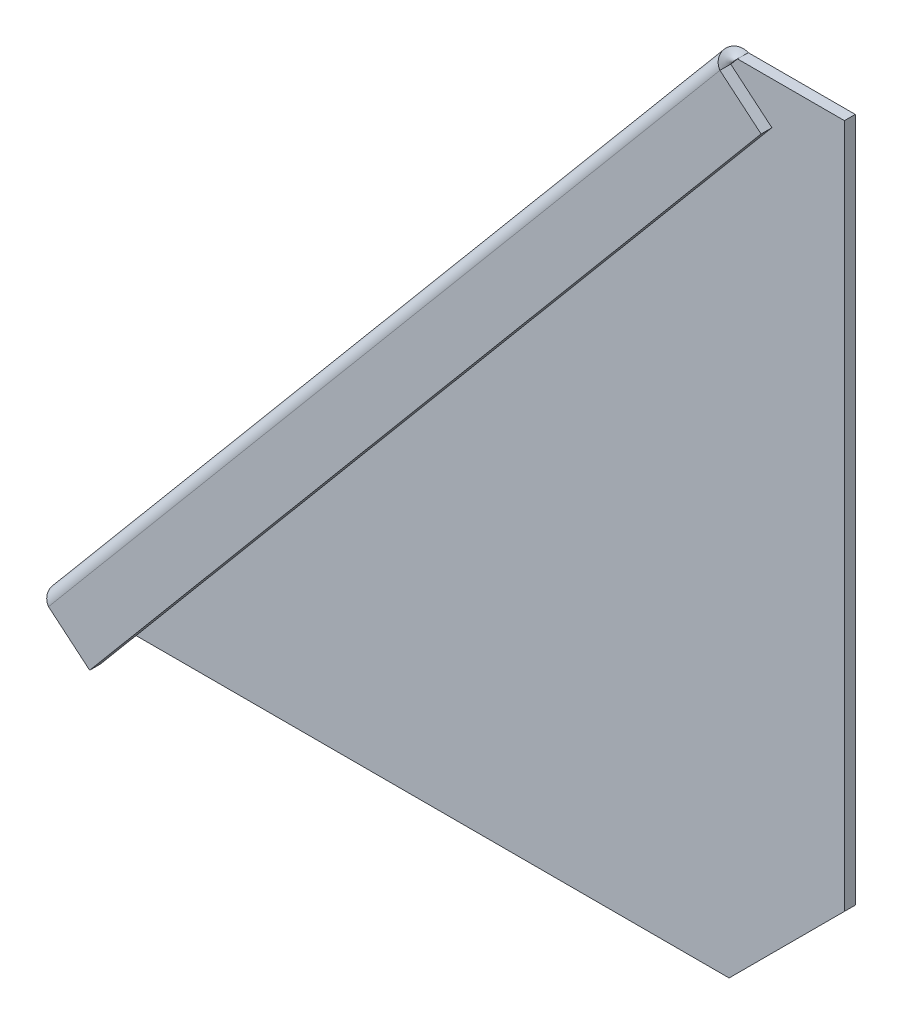
ISO-10303-21;
HEADER;
FILE_DESCRIPTION(('STEP AP214'),'2;1');
FILE_NAME('part.step','',(''),(''),'','','');
FILE_SCHEMA(('AUTOMOTIVE_DESIGN { 1 0 10303 214 1 1 1 1 }'));
ENDSEC;
DATA;
#1=APPLICATION_CONTEXT('core data for automotive mechanical design processes');
#2=APPLICATION_PROTOCOL_DEFINITION('international standard','automotive_design',2000,#1);
#3=PRODUCT_CONTEXT('',#1,'mechanical');
#4=PRODUCT('Part','Part','',(#3));
#5=PRODUCT_RELATED_PRODUCT_CATEGORY('part','',(#4));
#6=PRODUCT_DEFINITION_FORMATION('','',#4);
#7=PRODUCT_DEFINITION_CONTEXT('part definition',#1,'design');
#8=PRODUCT_DEFINITION('design','',#6,#7);
#9=PRODUCT_DEFINITION_SHAPE('','',#8);
#10=(LENGTH_UNIT() NAMED_UNIT(*) SI_UNIT(.MILLI.,.METRE.));
#11=(NAMED_UNIT(*) PLANE_ANGLE_UNIT() SI_UNIT($,.RADIAN.));
#12=(NAMED_UNIT(*) SI_UNIT($,.STERADIAN.) SOLID_ANGLE_UNIT());
#13=UNCERTAINTY_MEASURE_WITH_UNIT(LENGTH_MEASURE(1.E-05),#10,'distance_accuracy_value','');
#14=(GEOMETRIC_REPRESENTATION_CONTEXT(3) GLOBAL_UNCERTAINTY_ASSIGNED_CONTEXT((#13)) GLOBAL_UNIT_ASSIGNED_CONTEXT((#10,
#11,#12)) REPRESENTATION_CONTEXT('',''));
#15=CARTESIAN_POINT('',(0.,0.,0.));
#16=DIRECTION('',(0.,0.,1.));
#17=DIRECTION('',(1.,0.,0.));
#18=AXIS2_PLACEMENT_3D('',#15,#16,#17);
#19=CARTESIAN_POINT('',(0.,0.,-1.5));
#20=DIRECTION('',(0.,-1.,0.));
#21=DIRECTION('',(0.,0.,-1.));
#22=AXIS2_PLACEMENT_3D('',#19,#20,#21);
#23=PLANE('',#22);
#24=DIRECTION('',(1.,0.,0.));
#25=VECTOR('',#24,1.);
#26=CARTESIAN_POINT('',(0.,0.,0.));
#27=LINE('',#26,#25);
#28=CARTESIAN_POINT('',(2.02338129846504,0.,0.));
#29=VERTEX_POINT('',#28);
#30=CARTESIAN_POINT('',(93.9999999999999,0.,0.));
#31=VERTEX_POINT('',#30);
#32=EDGE_CURVE('E202',#29,#31,#27,.T.);
#33=ORIENTED_EDGE('',*,*,#32,.F.);
#34=DIRECTION('',(-1.49772966992418E-13,1.25674441363666E-13,-1.));
#35=VECTOR('',#34,1.);
#36=CARTESIAN_POINT('',(2.02338129846504,0.,0.));
#37=LINE('',#36,#35);
#38=CARTESIAN_POINT('',(2.02338129846504,0.,-1.5));
#39=VERTEX_POINT('',#38);
#40=EDGE_CURVE('E57',#29,#39,#37,.T.);
#41=ORIENTED_EDGE('',*,*,#40,.T.);
#42=DIRECTION('',(1.,0.,0.));
#43=VECTOR('',#42,1.);
#44=CARTESIAN_POINT('',(0.,0.,-1.5));
#45=LINE('',#44,#43);
#46=CARTESIAN_POINT('',(93.9999999999999,0.,-1.5));
#47=VERTEX_POINT('',#46);
#48=EDGE_CURVE('E129',#39,#47,#45,.T.);
#49=ORIENTED_EDGE('',*,*,#48,.T.);
#50=DIRECTION('',(0.,0.,1.));
#51=VECTOR('',#50,1.);
#52=CARTESIAN_POINT('',(93.9999999999999,0.,-1.5));
#53=LINE('',#52,#51);
#54=EDGE_CURVE('E218',#47,#31,#53,.T.);
#55=ORIENTED_EDGE('',*,*,#54,.T.);
#56=EDGE_LOOP('',(#33,#41,#49,#55));
#57=FACE_BOUND('',#56,.T.);
#58=ADVANCED_FACE('F41',(#57),#23,.T.);
#59=CARTESIAN_POINT('',(110.,111.,-1.5));
#60=DIRECTION('',(0.,1.,0.));
#61=DIRECTION('',(0.,0.,1.));
#62=AXIS2_PLACEMENT_3D('',#59,#60,#61);
#63=PLANE('',#62);
#64=DIRECTION('',(-1.49772966992418E-13,1.25674441363666E-13,-1.));
#65=VECTOR('',#64,1.);
#66=CARTESIAN_POINT('',(95.1634403591443,111.,0.));
#67=LINE('',#66,#65);
#68=CARTESIAN_POINT('',(95.1634403591442,111.,0.));
#69=VERTEX_POINT('',#68);
#70=CARTESIAN_POINT('',(95.163440359144,111.,-1.5));
#71=VERTEX_POINT('',#70);
#72=EDGE_CURVE('E119',#69,#71,#67,.T.);
#73=ORIENTED_EDGE('',*,*,#72,.F.);
#74=DIRECTION('',(-1.,0.,0.));
#75=VECTOR('',#74,1.);
#76=CARTESIAN_POINT('',(110.,111.,0.));
#77=LINE('',#76,#75);
#78=CARTESIAN_POINT('',(110.,111.,0.));
#79=VERTEX_POINT('',#78);
#80=EDGE_CURVE('E211',#79,#69,#77,.T.);
#81=ORIENTED_EDGE('',*,*,#80,.F.);
#82=DIRECTION('',(0.,0.,1.));
#83=VECTOR('',#82,1.);
#84=CARTESIAN_POINT('',(110.,111.,-1.5));
#85=LINE('',#84,#83);
#86=CARTESIAN_POINT('',(110.,111.,-1.5));
#87=VERTEX_POINT('',#86);
#88=EDGE_CURVE('E121',#87,#79,#85,.T.);
#89=ORIENTED_EDGE('',*,*,#88,.F.);
#90=DIRECTION('',(-1.,0.,0.));
#91=VECTOR('',#90,1.);
#92=CARTESIAN_POINT('',(110.,111.,-1.5));
#93=LINE('',#92,#91);
#94=EDGE_CURVE('E114',#87,#71,#93,.T.);
#95=ORIENTED_EDGE('',*,*,#94,.T.);
#96=EDGE_LOOP('',(#73,#81,#89,#95));
#97=FACE_BOUND('',#96,.T.);
#98=ADVANCED_FACE('F116',(#97),#63,.T.);
#99=CARTESIAN_POINT('',(110.,0.,-1.5));
#100=DIRECTION('',(1.,0.,0.));
#101=DIRECTION('',(0.,0.,-1.));
#102=AXIS2_PLACEMENT_3D('',#99,#100,#101);
#103=PLANE('',#102);
#104=DIRECTION('',(0.,1.,0.));
#105=VECTOR('',#104,1.);
#106=CARTESIAN_POINT('',(110.,0.,0.));
#107=LINE('',#106,#105);
#108=CARTESIAN_POINT('',(110.,16.0000000000001,0.));
#109=VERTEX_POINT('',#108);
#110=EDGE_CURVE('E214',#109,#79,#107,.T.);
#111=ORIENTED_EDGE('',*,*,#110,.F.);
#112=DIRECTION('',(0.,0.,-1.));
#113=VECTOR('',#112,1.);
#114=CARTESIAN_POINT('',(110.,16.0000000000001,-1.5));
#115=LINE('',#114,#113);
#116=CARTESIAN_POINT('',(110.,16.0000000000001,-1.5));
#117=VERTEX_POINT('',#116);
#118=EDGE_CURVE('E50',#109,#117,#115,.T.);
#119=ORIENTED_EDGE('',*,*,#118,.T.);
#120=DIRECTION('',(0.,1.,0.));
#121=VECTOR('',#120,1.);
#122=CARTESIAN_POINT('',(110.,0.,-1.5));
#123=LINE('',#122,#121);
#124=EDGE_CURVE('E124',#117,#87,#123,.T.);
#125=ORIENTED_EDGE('',*,*,#124,.T.);
#126=ORIENTED_EDGE('',*,*,#88,.T.);
#127=EDGE_LOOP('',(#111,#119,#125,#126));
#128=FACE_BOUND('',#127,.T.);
#129=ADVANCED_FACE('F225',(#128),#103,.T.);
#130=CARTESIAN_POINT('',(0.,0.,-1.5));
#131=DIRECTION('',(0.,0.,1.));
#132=DIRECTION('',(1.,0.,0.));
#133=AXIS2_PLACEMENT_3D('',#130,#131,#132);
#134=PLANE('',#133);
#135=ORIENTED_EDGE('',*,*,#48,.F.);
#136=DIRECTION('',(-0.642787609686543,-0.766044443118975,0.));
#137=VECTOR('',#136,1.);
#138=CARTESIAN_POINT('',(1.18736888683425,-0.996320795014009,-1.5));
#139=LINE('',#138,#137);
#140=EDGE_CURVE('E127',#39,#71,#139,.F.);
#141=ORIENTED_EDGE('',*,*,#140,.T.);
#142=ORIENTED_EDGE('',*,*,#94,.F.);
#143=ORIENTED_EDGE('',*,*,#124,.F.);
#144=DIRECTION('',(0.707106781186548,0.707106781186548,0.));
#145=VECTOR('',#144,1.);
#146=CARTESIAN_POINT('',(93.9999999999999,0.,-1.5));
#147=LINE('',#146,#145);
#148=EDGE_CURVE('E11',#117,#47,#147,.F.);
#149=ORIENTED_EDGE('',*,*,#148,.T.);
#150=EDGE_LOOP('',(#135,#141,#142,#143,#149));
#151=FACE_BOUND('',#150,.T.);
#152=ADVANCED_FACE('F128',(#151),#134,.F.);
#153=CARTESIAN_POINT('',(0.,0.,0.));
#154=DIRECTION('',(0.,0.,1.));
#155=DIRECTION('',(1.,0.,0.));
#156=AXIS2_PLACEMENT_3D('',#153,#154,#155);
#157=PLANE('',#156);
#158=DIRECTION('',(-0.642787609686543,-0.766044443118975,0.));
#159=VECTOR('',#158,1.);
#160=CARTESIAN_POINT('',(1.18736888683441,-0.996320795014141,0.));
#161=LINE('',#160,#159);
#162=EDGE_CURVE('E65',#29,#69,#161,.F.);
#163=ORIENTED_EDGE('',*,*,#162,.F.);
#164=ORIENTED_EDGE('',*,*,#32,.T.);
#165=DIRECTION('',(-0.707106781186548,-0.707106781186548,0.));
#166=VECTOR('',#165,1.);
#167=CARTESIAN_POINT('',(46.9999999999999,-46.9999999999999,0.));
#168=LINE('',#167,#166);
#169=EDGE_CURVE('E221',#31,#109,#168,.F.);
#170=ORIENTED_EDGE('',*,*,#169,.T.);
#171=ORIENTED_EDGE('',*,*,#110,.T.);
#172=ORIENTED_EDGE('',*,*,#80,.T.);
#173=EDGE_LOOP('',(#163,#164,#170,#171,#172));
#174=FACE_BOUND('',#173,.T.);
#175=ADVANCED_FACE('F230',(#174),#157,.T.);
#176=CARTESIAN_POINT('',(93.9999999999999,0.,-1.5));
#177=DIRECTION('',(-0.707106781186547,0.707106781186547,0.));
#178=DIRECTION('',(0.,0.,1.));
#179=AXIS2_PLACEMENT_3D('',#176,#177,#178);
#180=PLANE('',#179);
#181=ORIENTED_EDGE('',*,*,#148,.F.);
#182=ORIENTED_EDGE('',*,*,#118,.F.);
#183=ORIENTED_EDGE('',*,*,#169,.F.);
#184=ORIENTED_EDGE('',*,*,#54,.F.);
#185=EDGE_LOOP('',(#181,#182,#183,#184));
#186=FACE_BOUND('',#185,.T.);
#187=ADVANCED_FACE('F44',(#186),#180,.F.);
#188=CARTESIAN_POINT('',(4.0408844374526,-3.39070464109652,1.6));
#189=DIRECTION('',(0.642787609686543,0.766044443118975,0.));
#190=DIRECTION('',(-0.766044443118975,0.642787609686543,0.));
#191=AXIS2_PLACEMENT_3D('',#188,#189,#190);
#192=PLANE('',#191);
#193=DIRECTION('',(0.,0.,1.));
#194=VECTOR('',#193,1.);
#195=CARTESIAN_POINT('',(1.18736888683442,-0.996320795014143,1.6));
#196=LINE('',#195,#194);
#197=CARTESIAN_POINT('',(1.18736888683441,-0.996320795014147,0.1));
#198=VERTEX_POINT('',#197);
#199=CARTESIAN_POINT('',(1.18736888683442,-0.996320795014143,1.6));
#200=VERTEX_POINT('',#199);
#201=EDGE_CURVE('E193',#198,#200,#196,.T.);
#202=ORIENTED_EDGE('',*,*,#201,.F.);
#203=DIRECTION('',(-0.766044443118975,0.642787609686543,0.));
#204=VECTOR('',#203,1.);
#205=CARTESIAN_POINT('',(4.0408844374526,-3.39070464109652,0.1));
#206=LINE('',#205,#204);
#207=CARTESIAN_POINT('',(6.89439998807078,-5.78508848717889,0.1));
#208=VERTEX_POINT('',#207);
#209=EDGE_CURVE('E394',#208,#198,#206,.T.);
#210=ORIENTED_EDGE('',*,*,#209,.F.);
#211=DIRECTION('',(0.,0.,1.));
#212=VECTOR('',#211,1.);
#213=CARTESIAN_POINT('',(6.89439998807078,-5.78508848717889,1.6));
#214=LINE('',#213,#212);
#215=CARTESIAN_POINT('',(6.89439998807078,-5.78508848717889,1.6));
#216=VERTEX_POINT('',#215);
#217=EDGE_CURVE('E199',#208,#216,#214,.T.);
#218=ORIENTED_EDGE('',*,*,#217,.T.);
#219=DIRECTION('',(-0.766044443118975,0.642787609686543,0.));
#220=VECTOR('',#219,1.);
#221=CARTESIAN_POINT('',(4.0408844374526,-3.39070464109652,1.6));
#222=LINE('',#221,#220);
#223=EDGE_CURVE('E407',#216,#200,#222,.T.);
#224=ORIENTED_EDGE('',*,*,#223,.T.);
#225=EDGE_LOOP('',(#202,#210,#218,#224));
#226=FACE_BOUND('',#225,.T.);
#227=ADVANCED_FACE('F237',(#226),#192,.F.);
#228=CARTESIAN_POINT('',(53.4644295184103,49.7149115128211,1.6));
#229=DIRECTION('',(-0.766044443118975,0.642787609686543,0.));
#230=DIRECTION('',(-0.642787609686543,-0.766044443118975,0.));
#231=AXIS2_PLACEMENT_3D('',#228,#229,#230);
#232=PLANE('',#231);
#233=ORIENTED_EDGE('',*,*,#217,.F.);
#234=DIRECTION('',(-0.642787609686543,-0.766044443118975,0.));
#235=VECTOR('',#234,1.);
#236=CARTESIAN_POINT('',(53.4644295184103,49.7149115128211,0.1));
#237=LINE('',#236,#235);
#238=CARTESIAN_POINT('',(100.03445904875,105.214911512821,0.1));
#239=VERTEX_POINT('',#238);
#240=EDGE_CURVE('E393',#239,#208,#237,.T.);
#241=ORIENTED_EDGE('',*,*,#240,.F.);
#242=DIRECTION('',(0.,0.,1.));
#243=VECTOR('',#242,1.);
#244=CARTESIAN_POINT('',(100.03445904875,105.214911512821,1.6));
#245=LINE('',#244,#243);
#246=CARTESIAN_POINT('',(100.03445904875,105.214911512821,1.6));
#247=VERTEX_POINT('',#246);
#248=EDGE_CURVE('E204',#239,#247,#245,.T.);
#249=ORIENTED_EDGE('',*,*,#248,.T.);
#250=DIRECTION('',(-0.642787609686543,-0.766044443118975,0.));
#251=VECTOR('',#250,1.);
#252=CARTESIAN_POINT('',(53.4644295184103,49.7149115128211,1.6));
#253=LINE('',#252,#251);
#254=EDGE_CURVE('E209',#247,#216,#253,.T.);
#255=ORIENTED_EDGE('',*,*,#254,.T.);
#256=EDGE_LOOP('',(#233,#241,#249,#255));
#257=FACE_BOUND('',#256,.T.);
#258=ADVANCED_FACE('F273',(#257),#232,.F.);
#259=CARTESIAN_POINT('',(97.1809434981317,107.609295358903,1.6));
#260=DIRECTION('',(-0.642787609686543,-0.766044443118975,0.));
#261=DIRECTION('',(0.766044443118975,-0.642787609686543,0.));
#262=AXIS2_PLACEMENT_3D('',#259,#260,#261);
#263=PLANE('',#262);
#264=DIRECTION('',(0.766044443118975,-0.642787609686543,0.));
#265=VECTOR('',#264,1.);
#266=CARTESIAN_POINT('',(97.1809434981317,107.609295358903,0.1));
#267=LINE('',#266,#265);
#268=CARTESIAN_POINT('',(94.3274279475135,110.003679204986,0.1));
#269=VERTEX_POINT('',#268);
#270=EDGE_CURVE('E144',#269,#239,#267,.T.);
#271=ORIENTED_EDGE('',*,*,#270,.F.);
#272=DIRECTION('',(0.,0.,1.));
#273=VECTOR('',#272,1.);
#274=CARTESIAN_POINT('',(94.3274279475135,110.003679204986,1.6));
#275=LINE('',#274,#273);
#276=CARTESIAN_POINT('',(94.3274279475135,110.003679204986,1.6));
#277=VERTEX_POINT('',#276);
#278=EDGE_CURVE('E198',#269,#277,#275,.T.);
#279=ORIENTED_EDGE('',*,*,#278,.T.);
#280=DIRECTION('',(0.766044443118975,-0.642787609686543,0.));
#281=VECTOR('',#280,1.);
#282=CARTESIAN_POINT('',(97.1809434981317,107.609295358903,1.6));
#283=LINE('',#282,#281);
#284=EDGE_CURVE('E396',#277,#247,#283,.T.);
#285=ORIENTED_EDGE('',*,*,#284,.T.);
#286=ORIENTED_EDGE('',*,*,#248,.F.);
#287=EDGE_LOOP('',(#271,#279,#285,#286));
#288=FACE_BOUND('',#287,.T.);
#289=ADVANCED_FACE('F284',(#288),#263,.F.);
#290=CARTESIAN_POINT('',(50.6109139677921,52.1092953589035,1.6));
#291=DIRECTION('',(0.,0.,1.));
#292=DIRECTION('',(1.,0.,0.));
#293=AXIS2_PLACEMENT_3D('',#290,#291,#292);
#294=PLANE('',#293);
#295=ORIENTED_EDGE('',*,*,#254,.F.);
#296=ORIENTED_EDGE('',*,*,#284,.F.);
#297=DIRECTION('',(0.642787609686543,0.766044443118975,0.));
#298=VECTOR('',#297,1.);
#299=CARTESIAN_POINT('',(47.757398417174,54.5036792049859,1.6));
#300=LINE('',#299,#298);
#301=EDGE_CURVE('E148',#200,#277,#300,.T.);
#302=ORIENTED_EDGE('',*,*,#301,.F.);
#303=ORIENTED_EDGE('',*,*,#223,.F.);
#304=EDGE_LOOP('',(#295,#296,#302,#303));
#305=FACE_BOUND('',#304,.T.);
#306=ADVANCED_FACE('F295',(#305),#294,.T.);
#307=CARTESIAN_POINT('',(50.6109139677921,52.1092953589035,0.1));
#308=DIRECTION('',(0.,0.,1.));
#309=DIRECTION('',(1.,0.,0.));
#310=AXIS2_PLACEMENT_3D('',#307,#308,#309);
#311=PLANE('',#310);
#312=ORIENTED_EDGE('',*,*,#240,.T.);
#313=ORIENTED_EDGE('',*,*,#209,.T.);
#314=DIRECTION('',(0.642787609686543,0.766044443118975,0.));
#315=VECTOR('',#314,1.);
#316=CARTESIAN_POINT('',(47.757398417174,54.5036792049859,0.1));
#317=LINE('',#316,#315);
#318=EDGE_CURVE('E400',#198,#269,#317,.T.);
#319=ORIENTED_EDGE('',*,*,#318,.T.);
#320=ORIENTED_EDGE('',*,*,#270,.T.);
#321=EDGE_LOOP('',(#312,#313,#319,#320));
#322=FACE_BOUND('',#321,.T.);
#323=ADVANCED_FACE('F306',(#322),#311,.F.);
#324=CARTESIAN_POINT('',(95.1634403591441,111.,-1.515));
#325=CARTESIAN_POINT('',(94.9716438217637,111.090181943652,-1.515));
#326=CARTESIAN_POINT('',(94.7799737064075,111.180281851774,-1.47426723898597));
#327=CARTESIAN_POINT('',(94.4203365312737,111.34056839768,-1.31747569777449));
#328=CARTESIAN_POINT('',(94.2525159004185,111.410644189582,-1.20147860835306));
#329=CARTESIAN_POINT('',(93.9609151721406,111.513841378025,-0.911765616760604));
#330=CARTESIAN_POINT('',(93.8372223958869,111.546889503405,-0.738163704280434));
#331=CARTESIAN_POINT('',(93.6474454060445,111.564646430482,-0.359635439022158));
#332=CARTESIAN_POINT('',(93.5814084503322,111.549315578111,-0.154858020952636));
#333=CARTESIAN_POINT('',(93.511740749363,111.466288845193,0.25485802095307));
#334=CARTESIAN_POINT('',(93.5081100041062,111.398592964646,0.459635439022539));
#335=CARTESIAN_POINT('',(93.5585515920102,111.214782571734,0.838163704280742));
#336=CARTESIAN_POINT('',(93.6125766672947,111.098707713435,1.01176561676096));
#337=CARTESIAN_POINT('',(93.7648419936343,110.829457059157,1.30147860835334));
#338=CARTESIAN_POINT('',(93.8629949235202,110.676354534337,1.41747569777468));
#339=CARTESIAN_POINT('',(94.0832966967155,110.350014522595,1.57426723898607));
#340=CARTESIAN_POINT('',(94.2053109510254,110.176901991825,1.61500000000008));
#341=CARTESIAN_POINT('',(94.327427947514,110.003679204985,1.615));
#342=CARTESIAN_POINT('',(95.1634403591441,111.,-1.5));
#343=CARTESIAN_POINT('',(94.9731482656692,111.088919682545,-1.5));
#344=CARTESIAN_POINT('',(94.7829813640921,111.17775812732,-1.45965764883595));
#345=CARTESIAN_POINT('',(94.4261234490941,111.335712597072,-1.30436890194917));
#346=CARTESIAN_POINT('',(94.2595774519166,111.404718844324,-1.18948360571709));
#347=CARTESIAN_POINT('',(93.9701038772551,111.506131138952,-0.902547415960982));
#348=CARTESIAN_POINT('',(93.847262783996,111.538464617446,-0.730609419574871));
#349=CARTESIAN_POINT('',(93.6586370013952,111.555255566951,-0.35570922075677));
#350=CARTESIAN_POINT('',(93.592899116979,111.539673763966,-0.152894525544144));
#351=CARTESIAN_POINT('',(93.5232314160098,111.456647031048,0.252894525544574));
#352=CARTESIAN_POINT('',(93.5193015994568,111.389202101115,0.455709220757147));
#353=CARTESIAN_POINT('',(93.5685919801192,111.206357685775,0.830609419575176));
#354=CARTESIAN_POINT('',(93.6217653724092,111.090997474363,1.00254741596134));
#355=CARTESIAN_POINT('',(93.7719035451324,110.823531713899,1.28948360571736));
#356=CARTESIAN_POINT('',(93.8687818413406,110.671498733729,1.40436890194936));
#357=CARTESIAN_POINT('',(94.0863043544002,110.347490798141,1.55965764883604));
#358=CARTESIAN_POINT('',(94.2068152794918,110.175639593144,1.60000000000008));
#359=CARTESIAN_POINT('',(94.327427947514,110.003679204985,1.6));
#360=CARTESIAN_POINT('',(95.1634403591441,111.,0.));
#361=CARTESIAN_POINT('',(95.1235926562152,110.962693571907,0.));
#362=CARTESIAN_POINT('',(95.0837471325593,110.925385681929,0.00130136616658445));
#363=CARTESIAN_POINT('',(95.0048152311376,110.850132536194,0.0063106805822882));
#364=CARTESIAN_POINT('',(94.9657326017274,110.812184318564,0.0100166578800927));
#365=CARTESIAN_POINT('',(94.8889743887036,110.735107231696,0.0192726640012574));
#366=CARTESIAN_POINT('',(94.8513015949037,110.695976021526,0.0248190509814591));
#367=CARTESIAN_POINT('',(94.7777965364625,110.616169213848,0.0369126057820416));
#368=CARTESIAN_POINT('',(94.7419657816575,110.575492349436,0.0434550153050276));
#369=CARTESIAN_POINT('',(94.6722980806883,110.492465616518,0.0565449846949863));
#370=CARTESIAN_POINT('',(94.638461134524,110.450115748012,0.0630873942179719));
#371=CARTESIAN_POINT('',(94.5726307910268,110.363869089855,0.0751809490185531));
#372=CARTESIAN_POINT('',(94.5406358838575,110.319973567107,0.0807273359987537));
#373=CARTESIAN_POINT('',(94.4780586949429,110.230997188139,0.0899833421199158));
#374=CARTESIAN_POINT('',(94.4474736233838,110.185918672851,0.0936893194177188));
#375=CARTESIAN_POINT('',(94.3870701228672,110.09511835275,0.0986986338334192));
#376=CARTESIAN_POINT('',(94.3572481261385,110.049399725023,0.100000000000002));
#377=CARTESIAN_POINT('',(94.3274279475135,110.003679204986,0.1));
#378=B_SPLINE_SURFACE_WITH_KNOTS('',1,3,((#324,#325,#326,#327,#328,#329,#330,#331,#332,#333,
#334,#335,#336,#337,#338,#339,#340,#341),(#342,#343,#344,#345,#346,#347,#348,#349,#350,#351,
#352,#353,#354,#355,#356,#357,#358,#359),(#360,#361,#362,#363,#364,#365,#366,#367,#368,#369,
#370,#371,#372,#373,#374,#375,#376,#377)),.UNSPECIFIED.,.F.,.F.,.F.,(2,1,2),(4,2,2,2,2,2,2,2,4),
(-0.01,0.,1.),(0.,0.125,0.25,0.375,0.5,0.625,0.75,0.875,1.),.UNSPECIFIED.);
#379=CARTESIAN_POINT('',(95.1634403591441,111.,0.));
#380=CARTESIAN_POINT('',(95.1235725796549,110.962710601512,-6.57758902000603E-05));
#381=CARTESIAN_POINT('',(95.0837409231964,110.925390892203,0.00128407255946809));
#382=CARTESIAN_POINT('',(95.0048214405005,110.850127325919,0.00632797418940491));
#383=CARTESIAN_POINT('',(94.9657336142629,110.812183468946,0.0100220273696739));
#384=CARTESIAN_POINT('',(94.888973376168,110.735108081314,0.0192672945116751));
#385=CARTESIAN_POINT('',(94.8513009643107,110.695976550656,0.0248185084734067));
#386=CARTESIAN_POINT('',(94.7777971670554,110.616168684717,0.0369131482900946));
#387=CARTESIAN_POINT('',(94.7419657816575,110.575492349436,0.043456574145051));
#388=CARTESIAN_POINT('',(94.6722980806883,110.492465616518,0.0565434258549631));
#389=CARTESIAN_POINT('',(94.638461765117,110.450115218882,0.0630868517099189));
#390=CARTESIAN_POINT('',(94.5726301604338,110.363869618985,0.0751814915266052));
#391=CARTESIAN_POINT('',(94.540634871322,110.319974416725,0.0807327054883359));
#392=CARTESIAN_POINT('',(94.4780597074784,110.230996338521,0.0899779726303345));
#393=CARTESIAN_POINT('',(94.4474798327467,110.185913462577,0.093672025810602));
#394=CARTESIAN_POINT('',(94.3870639135042,110.095123563024,0.0987159274405359));
#395=CARTESIAN_POINT('',(94.3572278689935,110.049416539416,0.100065775890202));
#396=CARTESIAN_POINT('',(94.3274279475135,110.003679204986,0.1));
#397=B_SPLINE_CURVE_WITH_KNOTS('',3,(#379,#380,#381,#382,#383,#384,#385,#386,#387,#388,#389,
#390,#391,#392,#393,#394,#395,#396),.UNSPECIFIED.,.F.,.F.,(4,2,2,2,2,2,2,2,4),(0.,
0.163741909560372,0.327483819120766,0.491225728681118,0.654967638241489,0.818709547801866,
0.982451457362216,1.1461933669226,1.30993527648298),.UNSPECIFIED.);
#398=EDGE_CURVE('E143',#69,#269,#397,.T.);
#399=CARTESIAN_POINT('',(95.1634403591441,111.,-1.5));
#400=CARTESIAN_POINT('',(95.1193350301824,111.020608396703,-1.49999971308944));
#401=CARTESIAN_POINT('',(95.0752535659775,111.041206550204,-1.49785762616925));
#402=CARTESIAN_POINT('',(94.9873895971837,111.082153151759,-1.48931558930337));
#403=CARTESIAN_POINT('',(94.943607085419,111.102501605815,-1.48291574192109));
#404=CARTESIAN_POINT('',(94.813268622076,111.162743667712,-1.45740461058228));
#405=CARTESIAN_POINT('',(94.7275300255509,111.20192451504,-1.43198147631465));
#406=CARTESIAN_POINT('',(94.5640387077386,111.274887048519,-1.36645399527717));
#407=CARTESIAN_POINT('',(94.4861048822304,111.308819822754,-1.32696170206202));
#408=CARTESIAN_POINT('',(94.3364508704632,111.371477607575,-1.23442145284293));
#409=CARTESIAN_POINT('',(94.2647289428359,111.400204080115,-1.18137731237613));
#410=CARTESIAN_POINT('',(94.129200075446,111.451011795911,-1.06334252458044));
#411=CARTESIAN_POINT('',(94.0653933810351,111.473092833206,-0.998351507084057));
#412=CARTESIAN_POINT('',(93.9471545312908,111.509387527096,-0.858386142078131));
#413=CARTESIAN_POINT('',(93.892724068654,111.523599764156,-0.783409996270484));
#414=CARTESIAN_POINT('',(93.7944370119899,111.543148947445,-0.62577102970827));
#415=CARTESIAN_POINT('',(93.7505798042619,111.548486408897,-0.543108655469533));
#416=CARTESIAN_POINT('',(93.6743037835524,111.549569241968,-0.372612382020862));
#417=CARTESIAN_POINT('',(93.6418842227282,111.545315240853,-0.284778821363755));
#418=CARTESIAN_POINT('',(93.5889909870066,111.526779937705,-0.106605542924295));
#419=CARTESIAN_POINT('',(93.5685176758899,111.512498330345,-0.0162657489112341));
#420=CARTESIAN_POINT('',(93.539671537229,111.473782507929,0.164170124231445));
#421=CARTESIAN_POINT('',(93.5312987370492,111.449348269913,0.254266202809462));
#422=CARTESIAN_POINT('',(93.5264371257851,111.390509332848,0.431470939223913));
#423=CARTESIAN_POINT('',(93.5299479693197,111.356104923594,0.51857968380861));
#424=CARTESIAN_POINT('',(93.5482739841162,111.277807074941,0.687166947605795));
#425=CARTESIAN_POINT('',(93.5630897705932,111.233913119215,0.768645160141449));
#426=CARTESIAN_POINT('',(93.6031083455022,111.137411464367,0.923491481298686));
#427=CARTESIAN_POINT('',(93.6283115653035,111.08480340342,0.996859252949398));
#428=CARTESIAN_POINT('',(93.6878578442537,110.971918157994,1.13323798394172));
#429=CARTESIAN_POINT('',(93.7221996482213,110.911642027314,1.19625036367152));
#430=CARTESIAN_POINT('',(93.7985162176203,110.784688979714,1.31001564553898));
#431=CARTESIAN_POINT('',(93.8404910342526,110.718012019861,1.3607684654363));
#432=CARTESIAN_POINT('',(93.9303201791187,110.579718445861,1.44847454455374));
#433=CARTESIAN_POINT('',(93.9781752452372,110.508101212278,1.4854260695593));
#434=CARTESIAN_POINT('',(94.0755124697353,110.364976600985,1.54301026661158));
#435=CARTESIAN_POINT('',(94.1248120818223,110.293622652983,1.56432905562839));
#436=CARTESIAN_POINT('',(94.2000887827088,110.18549869128,1.58570209712029));
#437=CARTESIAN_POINT('',(94.2254168144157,110.149254554181,1.59105894436937));
#438=CARTESIAN_POINT('',(94.2763023866992,110.076571897206,1.59820813543987));
#439=CARTESIAN_POINT('',(94.3018599456718,110.040133361848,1.60000019094616));
#440=CARTESIAN_POINT('',(94.327427947514,110.003679204985,1.6));
#441=B_SPLINE_CURVE_WITH_KNOTS('',3,(#399,#400,#401,#402,#403,#404,#405,#406,#407,#408,#409,
#410,#411,#412,#413,#414,#415,#416,#417,#418,#419,#420,#421,#422,#423,#424,#425,#426,#427,#428,
#429,#430,#431,#432,#433,#434,#435,#436,#437,#438,#439,#440),.UNSPECIFIED.,.F.,.F.,(4,2,2,2,2,2,
2,2,2,2,2,2,2,2,2,2,2,2,2,2,4),(0.,0.14594888794743,0.29189426032062,0.583157694211031,
0.863047563533527,1.14285871624031,1.4226785402052,1.70254882738396,1.98240286621249,
2.262238603584,2.54208286191581,2.82192775309137,3.10176451104524,3.38161649880678,
3.66148010943257,3.94130530071544,4.22113236908679,4.50099458756896,4.76768679063319,
4.90118278071966,5.03468956732666),.UNSPECIFIED.);
#442=EDGE_CURVE('E134',#71,#277,#441,.T.);
#443=ORIENTED_EDGE('',*,*,#278,.F.);
#444=ORIENTED_EDGE('',*,*,#398,.F.);
#445=ORIENTED_EDGE('',*,*,#72,.T.);
#446=ORIENTED_EDGE('',*,*,#442,.T.);
#447=EDGE_LOOP('',(#443,#444,#445,#446));
#448=FACE_BOUND('',#447,.T.);
#449=ADVANCED_FACE('F141',(#448),#378,.F.);
#450=CARTESIAN_POINT('',(1.18736888683441,-0.996320795014147,1.615));
#451=CARTESIAN_POINT('',(1.06525189034624,-0.823098008175235,1.615));
#452=CARTESIAN_POINT('',(0.943237636036034,-0.649985477404291,1.57426723898592));
#453=CARTESIAN_POINT('',(0.72293586284077,-0.323645465662354,1.41747569777443));
#454=CARTESIAN_POINT('',(0.624782932955035,-0.170542940843222,1.30147860835318));
#455=CARTESIAN_POINT('',(0.472517606615517,0.0987077134354441,1.0117656167608));
#456=CARTESIAN_POINT('',(0.418492531330994,0.214782571734055,0.838163704280537));
#457=CARTESIAN_POINT('',(0.368050943427069,0.398592964646321,0.459635439022384));
#458=CARTESIAN_POINT('',(0.371681688683936,0.466288845193429,0.254858020952959));
#459=CARTESIAN_POINT('',(0.441349389653127,0.549315578111298,-0.154858020952688));
#460=CARTESIAN_POINT('',(0.507386345365454,0.564646430482056,-0.359635439022118));
#461=CARTESIAN_POINT('',(0.697163335207762,0.546889503405525,-0.738163704280299));
#462=CARTESIAN_POINT('',(0.820856111461486,0.513841378024772,-0.911765616760586));
#463=CARTESIAN_POINT('',(1.1124568397394,0.410644189581831,-1.20147860835302));
#464=CARTESIAN_POINT('',(1.28027747059434,0.340568397680557,-1.3174756977743));
#465=CARTESIAN_POINT('',(1.63991464572802,0.180281851774329,-1.47426723898585));
#466=CARTESIAN_POINT('',(1.83158476108516,0.0901819436513187,-1.51499999999996));
#467=CARTESIAN_POINT('',(2.02338129846484,1.64405927520969E-13,-1.515));
#468=CARTESIAN_POINT('',(1.18736888683441,-0.996320795014147,1.6));
#469=CARTESIAN_POINT('',(1.06675621881271,-0.824360406856436,1.6));
#470=CARTESIAN_POINT('',(0.946245293720708,-0.652509201858208,1.55965764883589));
#471=CARTESIAN_POINT('',(0.728722780661205,-0.328501266271135,1.40436890194912));
#472=CARTESIAN_POINT('',(0.631844484453141,-0.176468286100822,1.28948360571721));
#473=CARTESIAN_POINT('',(0.481706311730001,0.0909974743628837,1.00254741596118));
#474=CARTESIAN_POINT('',(0.42853291944007,0.206357685774852,0.830609419574973));
#475=CARTESIAN_POINT('',(0.379242538777741,0.389202101115287,0.455709220756994));
#476=CARTESIAN_POINT('',(0.383172355330721,0.456647031048131,0.252894525544464));
#477=CARTESIAN_POINT('',(0.452840056299911,0.539673763966,-0.152894525544196));
#478=CARTESIAN_POINT('',(0.518577940716127,0.555255566951021,-0.35570922075673));
#479=CARTESIAN_POINT('',(0.70720372331684,0.538464617446321,-0.730609419574737));
#480=CARTESIAN_POINT('',(0.830044816575971,0.506131138952211,-0.902547415960963));
#481=CARTESIAN_POINT('',(1.11951839123751,0.40471884432423,-1.18948360571705));
#482=CARTESIAN_POINT('',(1.28606438841478,0.335712597071775,-1.30436890194899));
#483=CARTESIAN_POINT('',(1.6429223034127,0.17775812732041,-1.45965764883582));
#484=CARTESIAN_POINT('',(1.83308920499062,0.0889196825449431,-1.49999999999996));
#485=CARTESIAN_POINT('',(2.02338129846484,1.6277962426224E-13,-1.5));
#486=CARTESIAN_POINT('',(1.18736888683441,-0.996320795014147,0.1));
#487=CARTESIAN_POINT('',(1.2171890654594,-0.95060027497649,0.1));
#488=CARTESIAN_POINT('',(1.24701106218805,-0.904881647249911,0.098698633833416));
#489=CARTESIAN_POINT('',(1.30741456270473,-0.814081327149188,0.0936893194177136));
#490=CARTESIAN_POINT('',(1.33799963426377,-0.769002811860866,0.0899833421199101));
#491=CARTESIAN_POINT('',(1.4005768231784,-0.680026432893154,0.0807273359987478));
#492=CARTESIAN_POINT('',(1.4325717303477,-0.636130910145424,0.0751809490185475));
#493=CARTESIAN_POINT('',(1.49840207384494,-0.54988425198814,0.0630873942179675));
#494=CARTESIAN_POINT('',(1.53223902000917,-0.507534383481672,0.0565449846949827));
#495=CARTESIAN_POINT('',(1.60190672097839,-0.424507650563826,0.043455015305026));
#496=CARTESIAN_POINT('',(1.63773747578337,-0.383830786152449,0.036912605782041));
#497=CARTESIAN_POINT('',(1.71124253422457,-0.304023978474041,0.0248190509814601));
#498=CARTESIAN_POINT('',(1.74891532802449,-0.264892768303925,0.0192726640012592));
#499=CARTESIAN_POINT('',(1.8256735410483,-0.187815681435946,0.0100166578800952));
#500=CARTESIAN_POINT('',(1.86475617045848,-0.149867463806422,0.00631068058229079));
#501=CARTESIAN_POINT('',(1.94368807188024,-0.074614318071455,0.00130136616658634));
#502=CARTESIAN_POINT('',(1.98353359553613,-0.0373064280926225,0.));
#503=CARTESIAN_POINT('',(2.02338129846504,0.,0.));
#504=B_SPLINE_SURFACE_WITH_KNOTS('',1,3,((#450,#451,#452,#453,#454,#455,#456,#457,#458,#459,
#460,#461,#462,#463,#464,#465,#466,#467),(#468,#469,#470,#471,#472,#473,#474,#475,#476,#477,
#478,#479,#480,#481,#482,#483,#484,#485),(#486,#487,#488,#489,#490,#491,#492,#493,#494,#495,
#496,#497,#498,#499,#500,#501,#502,#503)),.UNSPECIFIED.,.F.,.F.,.F.,(2,1,2),(4,2,2,2,2,2,2,2,4),
(-0.01,0.,1.),(0.,0.125,0.25,0.375,0.5,0.625,0.75,0.875,1.),.UNSPECIFIED.);
#505=CARTESIAN_POINT('',(1.18736888683441,-0.996320795014147,0.1));
#506=CARTESIAN_POINT('',(1.21716880831438,-0.95058346058406,0.100065775890201));
#507=CARTESIAN_POINT('',(1.24700485282516,-0.9048764369758,0.0987159274405331));
#508=CARTESIAN_POINT('',(1.30742077206762,-0.8140865374233,0.0936720258105965));
#509=CARTESIAN_POINT('',(1.33800064679931,-0.769003661479059,0.0899779726303281));
#510=CARTESIAN_POINT('',(1.40057581064287,-0.680025583274961,0.0807327054883299));
#511=CARTESIAN_POINT('',(1.43257109975474,-0.636130381015104,0.0751814915266));
#512=CARTESIAN_POINT('',(1.49840270443789,-0.54988478111846,0.063086851709915));
#513=CARTESIAN_POINT('',(1.53223902000917,-0.507534383481672,0.0565434258549597));
#514=CARTESIAN_POINT('',(1.60190672097839,-0.424507650563826,0.043456574145049));
#515=CARTESIAN_POINT('',(1.63773810637633,-0.383831315282768,0.0369131482900935));
#516=CARTESIAN_POINT('',(1.71124190363162,-0.304023449343721,0.0248185084734076));
#517=CARTESIAN_POINT('',(1.74891431548896,-0.264891918685732,0.0192672945116771));
#518=CARTESIAN_POINT('',(1.82567455358384,-0.187816531054139,0.0100220273696773));
#519=CARTESIAN_POINT('',(1.86476237982137,-0.149872674080534,0.00632797418940793));
#520=CARTESIAN_POINT('',(1.94368186251735,-0.0746091077973435,0.0012840725594692));
#521=CARTESIAN_POINT('',(1.98351351897579,-0.037289398487758,-6.57758902001556E-05));
#522=CARTESIAN_POINT('',(2.02338129846504,0.,0.));
#523=B_SPLINE_CURVE_WITH_KNOTS('',3,(#505,#506,#507,#508,#509,#510,#511,#512,#513,#514,#515,
#516,#517,#518,#519,#520,#521,#522),.UNSPECIFIED.,.F.,.F.,(4,2,2,2,2,2,2,2,4),(0.,
0.163741909560368,0.327483819120737,0.491225728681105,0.654967638241474,0.818709547801842,
0.982451457362211,1.14619336692258,1.30993527648295),.UNSPECIFIED.);
#524=EDGE_CURVE('E181',#198,#29,#523,.T.);
#525=CARTESIAN_POINT('',(1.18736888683441,-0.996320795014147,1.6));
#526=CARTESIAN_POINT('',(1.15941476798433,-0.956464135635271,1.59999971308944));
#527=CARTESIAN_POINT('',(1.13147488079028,-0.916629199740768,1.59785762616922));
#528=CARTESIAN_POINT('',(1.07589293205603,-0.837210384803298,1.58931558930324));
#529=CARTESIAN_POINT('',(1.0482508633581,-0.79762649973606,1.58291574192088));
#530=CARTESIAN_POINT('',(0.96629097710458,-0.679729094786784,1.55740461058176));
#531=CARTESIAN_POINT('',(0.912817023843812,-0.602096742933984,1.53198147631382));
#532=CARTESIAN_POINT('',(0.812572985790884,-0.453759036578622,1.46645399527575));
#533=CARTESIAN_POINT('',(0.765622659865016,-0.38290156540535,1.42696170206043));
#534=CARTESIAN_POINT('',(0.677929641163343,-0.246401544498451,1.33442145284099));
#535=CARTESIAN_POINT('',(0.637185206257784,-0.180757533717667,1.28137731237403));
#536=CARTESIAN_POINT('',(0.56361503298572,-0.0561103216146185,1.16334252457802));
#537=CARTESIAN_POINT('',(0.530789540056216,0.00289267384804321,1.0983515070815));
#538=CARTESIAN_POINT('',(0.474514283332713,0.113032702330246,0.958386142075318));
#539=CARTESIAN_POINT('',(0.451066211442277,0.164168314868908,0.883409996267557));
#540=CARTESIAN_POINT('',(0.414746655896399,0.257567490239239,0.725771029705138));
#541=CARTESIAN_POINT('',(0.401874558277993,0.299831567980635,0.64310865546631));
#542=CARTESIAN_POINT('',(0.387562983878633,0.374760752554453,0.472612382017507));
#543=CARTESIAN_POINT('',(0.38612275950006,0.40742648694462,0.384778821360361));
#544=CARTESIAN_POINT('',(0.395191655751465,0.462734777179185,0.20660554292085));
#545=CARTESIAN_POINT('',(0.405701140238716,0.485377027788866,0.116265748907778));
#546=CARTESIAN_POINT('',(0.4388197029076,0.520507860795771,-0.0641701242348973));
#547=CARTESIAN_POINT('',(0.461428808451371,0.532996420231231,-0.154266202812898));
#548=CARTESIAN_POINT('',(0.518529639915987,0.548001446893183,-0.331470939227273));
#549=CARTESIAN_POINT('',(0.553021020469334,0.550518203931237,-0.418579683811911));
#550=CARTESIAN_POINT('',(0.633311627939679,0.546066881211346,-0.58716694760895));
#551=CARTESIAN_POINT('',(0.679111470171613,0.539098285244139,-0.668645160144516));
#552=CARTESIAN_POINT('',(0.781096200650438,0.516445018915248,-0.823491481301548));
#553=CARTESIAN_POINT('',(0.837281520131972,0.500759986567979,-0.896859252952141));
#554=CARTESIAN_POINT('',(0.958791887855714,0.461720666548428,-1.0332379839442));
#555=CARTESIAN_POINT('',(1.02411568034801,0.438367431997969,-1.09625036367387));
#556=CARTESIAN_POINT('',(1.16239225909433,0.385255448135225,-1.21001564554101));
#557=CARTESIAN_POINT('',(1.23534509652128,0.355496655855316,-1.26076846543815));
#558=CARTESIAN_POINT('',(1.38713634769567,0.291046644652833,-1.34847454455524));
#559=CARTESIAN_POINT('',(1.46597549960096,0.256354806619502,-1.38542606956062));
#560=CARTESIAN_POINT('',(1.62382815810241,0.18534968120767,-1.4430102666123));
#561=CARTESIAN_POINT('',(1.7026588671005,0.149189524044042,-1.4643290556288));
#562=CARTESIAN_POINT('',(1.82221184480129,0.0938319743023096,-1.48570209712041));
#563=CARTESIAN_POINT('',(1.86230351856721,0.0751824606673559,-1.49105894436943));
#564=CARTESIAN_POINT('',(1.9427181495608,0.0376911654979299,-1.49820813543985));
#565=CARTESIAN_POINT('',(1.98304112523135,0.0188493685357275,-1.50000019094614));
#566=CARTESIAN_POINT('',(2.02338129846484,1.6277962426224E-13,-1.5));
#567=B_SPLINE_CURVE_WITH_KNOTS('',3,(#525,#526,#527,#528,#529,#530,#531,#532,#533,#534,#535,
#536,#537,#538,#539,#540,#541,#542,#543,#544,#545,#546,#547,#548,#549,#550,#551,#552,#553,#554,
#555,#556,#557,#558,#559,#560,#561,#562,#563,#564,#565,#566),.UNSPECIFIED.,.F.,.F.,(4,2,2,2,2,2,
2,2,2,2,2,2,2,2,2,2,2,2,2,2,4),(0.,0.145948887948322,0.291894260322407,0.583157694214587,
0.863047563537066,1.14285871624387,1.42267854020878,1.70254882738755,1.98240286621607,
2.26223860358758,2.5420828619194,2.82192775309496,3.10176451104882,3.38161649881036,
3.66148010943616,3.94130530071905,4.2211323690904,4.50099458757257,4.76768679063457,
4.90118278071992,5.03468956732582),.UNSPECIFIED.);
#568=EDGE_CURVE('E135',#200,#39,#567,.T.);
#569=ORIENTED_EDGE('',*,*,#524,.F.);
#570=ORIENTED_EDGE('',*,*,#201,.T.);
#571=ORIENTED_EDGE('',*,*,#568,.T.);
#572=ORIENTED_EDGE('',*,*,#40,.F.);
#573=EDGE_LOOP('',(#569,#570,#571,#572));
#574=FACE_BOUND('',#573,.T.);
#575=ADVANCED_FACE('F171',(#574),#504,.F.);
#576=CARTESIAN_POINT('',(1.18736888683441,-0.996320795014147,0.05));
#577=DIRECTION('',(-0.642787609686543,-0.766044443118975,0.));
#578=DIRECTION('',(0.,0.,1.));
#579=AXIS2_PLACEMENT_3D('',#576,#577,#578);
#580=CYLINDRICAL_SURFACE('',#579,1.55);
#581=ORIENTED_EDGE('',*,*,#140,.F.);
#582=ORIENTED_EDGE('',*,*,#568,.F.);
#583=ORIENTED_EDGE('',*,*,#301,.T.);
#584=ORIENTED_EDGE('',*,*,#442,.F.);
#585=EDGE_LOOP('',(#581,#582,#583,#584));
#586=FACE_BOUND('',#585,.T.);
#587=ADVANCED_FACE('F147',(#586),#580,.T.);
#588=CARTESIAN_POINT('',(1.18736888683441,-0.996320795014147,0.05));
#589=DIRECTION('',(-0.642787609686543,-0.766044443118975,0.));
#590=DIRECTION('',(0.,0.,1.));
#591=AXIS2_PLACEMENT_3D('',#588,#589,#590);
#592=CYLINDRICAL_SURFACE('',#591,0.05);
#593=ORIENTED_EDGE('',*,*,#162,.T.);
#594=ORIENTED_EDGE('',*,*,#398,.T.);
#595=ORIENTED_EDGE('',*,*,#318,.F.);
#596=ORIENTED_EDGE('',*,*,#524,.T.);
#597=EDGE_LOOP('',(#593,#594,#595,#596));
#598=FACE_BOUND('',#597,.T.);
#599=ADVANCED_FACE('F170',(#598),#592,.F.);
#600=CLOSED_SHELL('',(#58,#98,#129,#152,#175,#187,#227,#258,#289,#306,#323,#449,#575,#587,#599));
#601=MANIFOLD_SOLID_BREP('B2',#600);
#602=ADVANCED_BREP_SHAPE_REPRESENTATION('',(#18,#601),#14);
#603=SHAPE_DEFINITION_REPRESENTATION(#9,#602);
ENDSEC;
END-ISO-10303-21;
